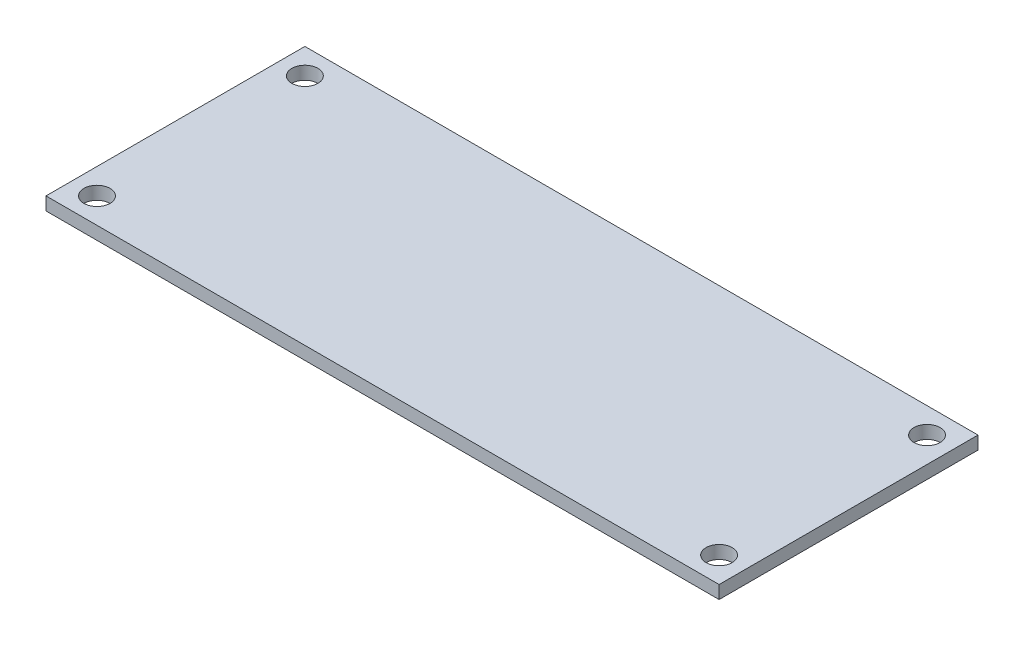
ISO-10303-21;
HEADER;
FILE_DESCRIPTION(('STEP AP214'),'2;1');
FILE_NAME('part.step','',(''),(''),'','','');
FILE_SCHEMA(('AUTOMOTIVE_DESIGN { 1 0 10303 214 1 1 1 1 }'));
ENDSEC;
DATA;
#1=APPLICATION_CONTEXT('core data for automotive mechanical design processes');
#2=APPLICATION_PROTOCOL_DEFINITION('international standard','automotive_design',2000,#1);
#3=PRODUCT_CONTEXT('',#1,'mechanical');
#4=PRODUCT('Part','Part','',(#3));
#5=PRODUCT_RELATED_PRODUCT_CATEGORY('part','',(#4));
#6=PRODUCT_DEFINITION_FORMATION('','',#4);
#7=PRODUCT_DEFINITION_CONTEXT('part definition',#1,'design');
#8=PRODUCT_DEFINITION('design','',#6,#7);
#9=PRODUCT_DEFINITION_SHAPE('','',#8);
#10=(LENGTH_UNIT() NAMED_UNIT(*) SI_UNIT(.MILLI.,.METRE.));
#11=(NAMED_UNIT(*) PLANE_ANGLE_UNIT() SI_UNIT($,.RADIAN.));
#12=(NAMED_UNIT(*) SI_UNIT($,.STERADIAN.) SOLID_ANGLE_UNIT());
#13=UNCERTAINTY_MEASURE_WITH_UNIT(LENGTH_MEASURE(1.E-05),#10,'distance_accuracy_value','');
#14=(GEOMETRIC_REPRESENTATION_CONTEXT(3) GLOBAL_UNCERTAINTY_ASSIGNED_CONTEXT((#13)) GLOBAL_UNIT_ASSIGNED_CONTEXT((#10,
#11,#12)) REPRESENTATION_CONTEXT('',''));
#15=CARTESIAN_POINT('',(0.,0.,0.));
#16=DIRECTION('',(0.,0.,1.));
#17=DIRECTION('',(1.,0.,0.));
#18=AXIS2_PLACEMENT_3D('',#15,#16,#17);
#19=CARTESIAN_POINT('',(0.,0.8,0.));
#20=DIRECTION('',(0.,-1.,0.));
#21=DIRECTION('',(0.,0.,-1.));
#22=AXIS2_PLACEMENT_3D('',#19,#20,#21);
#23=PLANE('',#22);
#24=DIRECTION('',(0.,0.,-1.));
#25=VECTOR('',#24,1.);
#26=CARTESIAN_POINT('',(41.275,0.8,15.875));
#27=LINE('',#26,#25);
#28=CARTESIAN_POINT('',(41.275,0.8,15.875));
#29=VERTEX_POINT('',#28);
#30=CARTESIAN_POINT('',(41.275,0.8,-15.875));
#31=VERTEX_POINT('',#30);
#32=EDGE_CURVE('E86',#29,#31,#27,.T.);
#33=ORIENTED_EDGE('',*,*,#32,.T.);
#34=DIRECTION('',(-1.,0.,0.));
#35=VECTOR('',#34,1.);
#36=CARTESIAN_POINT('',(-41.275,0.8,-15.875));
#37=LINE('',#36,#35);
#38=CARTESIAN_POINT('',(-41.275,0.8,-15.875));
#39=VERTEX_POINT('',#38);
#40=EDGE_CURVE('E81',#31,#39,#37,.T.);
#41=ORIENTED_EDGE('',*,*,#40,.T.);
#42=DIRECTION('',(0.,0.,1.));
#43=VECTOR('',#42,1.);
#44=CARTESIAN_POINT('',(-41.275,0.8,15.875));
#45=LINE('',#44,#43);
#46=CARTESIAN_POINT('',(-41.275,0.8,15.875));
#47=VERTEX_POINT('',#46);
#48=EDGE_CURVE('E84',#39,#47,#45,.T.);
#49=ORIENTED_EDGE('',*,*,#48,.T.);
#50=DIRECTION('',(1.,0.,0.));
#51=VECTOR('',#50,1.);
#52=CARTESIAN_POINT('',(-41.275,0.8,15.875));
#53=LINE('',#52,#51);
#54=EDGE_CURVE('E51',#47,#29,#53,.T.);
#55=ORIENTED_EDGE('',*,*,#54,.T.);
#56=EDGE_LOOP('',(#33,#41,#49,#55));
#57=FACE_BOUND('',#56,.T.);
#58=CARTESIAN_POINT('',(-38.15,0.8,-12.75));
#59=DIRECTION('',(0.,1.,0.));
#60=DIRECTION('',(0.,0.,1.));
#61=AXIS2_PLACEMENT_3D('',#58,#59,#60);
#62=CIRCLE('',#61,1.6);
#63=CARTESIAN_POINT('',(-38.15,0.8,-11.15));
#64=VERTEX_POINT('',#63);
#65=EDGE_CURVE('E101',#64,#64,#62,.T.);
#66=ORIENTED_EDGE('',*,*,#65,.F.);
#67=EDGE_LOOP('',(#66));
#68=FACE_BOUND('',#67,.T.);
#69=CARTESIAN_POINT('',(38.15,0.8,-12.75));
#70=DIRECTION('',(0.,1.,0.));
#71=DIRECTION('',(0.,0.,1.));
#72=AXIS2_PLACEMENT_3D('',#69,#70,#71);
#73=CIRCLE('',#72,1.6);
#74=CARTESIAN_POINT('',(38.15,0.8,-11.15));
#75=VERTEX_POINT('',#74);
#76=EDGE_CURVE('E116',#75,#75,#73,.T.);
#77=ORIENTED_EDGE('',*,*,#76,.F.);
#78=EDGE_LOOP('',(#77));
#79=FACE_BOUND('',#78,.T.);
#80=CARTESIAN_POINT('',(38.15,0.8,12.75));
#81=DIRECTION('',(0.,1.,0.));
#82=DIRECTION('',(0.,0.,1.));
#83=AXIS2_PLACEMENT_3D('',#80,#81,#82);
#84=CIRCLE('',#83,1.6);
#85=CARTESIAN_POINT('',(38.15,0.8,14.35));
#86=VERTEX_POINT('',#85);
#87=EDGE_CURVE('E122',#86,#86,#84,.T.);
#88=ORIENTED_EDGE('',*,*,#87,.F.);
#89=EDGE_LOOP('',(#88));
#90=FACE_BOUND('',#89,.T.);
#91=CARTESIAN_POINT('',(-38.15,0.8,12.75));
#92=DIRECTION('',(0.,1.,0.));
#93=DIRECTION('',(0.,0.,1.));
#94=AXIS2_PLACEMENT_3D('',#91,#92,#93);
#95=CIRCLE('',#94,1.6);
#96=CARTESIAN_POINT('',(-38.15,0.8,14.35));
#97=VERTEX_POINT('',#96);
#98=EDGE_CURVE('E128',#97,#97,#95,.T.);
#99=ORIENTED_EDGE('',*,*,#98,.F.);
#100=EDGE_LOOP('',(#99));
#101=FACE_BOUND('',#100,.T.);
#102=ADVANCED_FACE('F34',(#57,#68,#79,#90,#101),#23,.F.);
#103=CARTESIAN_POINT('',(0.,-0.8,0.));
#104=DIRECTION('',(0.,-1.,0.));
#105=DIRECTION('',(0.,0.,-1.));
#106=AXIS2_PLACEMENT_3D('',#103,#104,#105);
#107=PLANE('',#106);
#108=CARTESIAN_POINT('',(38.15,-0.8,12.75));
#109=DIRECTION('',(0.,1.,0.));
#110=DIRECTION('',(0.,0.,1.));
#111=AXIS2_PLACEMENT_3D('',#108,#109,#110);
#112=CIRCLE('',#111,1.6);
#113=CARTESIAN_POINT('',(38.15,-0.8,14.35));
#114=VERTEX_POINT('',#113);
#115=EDGE_CURVE('E125',#114,#114,#112,.T.);
#116=ORIENTED_EDGE('',*,*,#115,.T.);
#117=EDGE_LOOP('',(#116));
#118=FACE_BOUND('',#117,.T.);
#119=CARTESIAN_POINT('',(-38.15,-0.8,-12.75));
#120=DIRECTION('',(0.,1.,0.));
#121=DIRECTION('',(0.,0.,1.));
#122=AXIS2_PLACEMENT_3D('',#119,#120,#121);
#123=CIRCLE('',#122,1.6);
#124=CARTESIAN_POINT('',(-38.15,-0.8,-11.15));
#125=VERTEX_POINT('',#124);
#126=EDGE_CURVE('E113',#125,#125,#123,.T.);
#127=ORIENTED_EDGE('',*,*,#126,.T.);
#128=EDGE_LOOP('',(#127));
#129=FACE_BOUND('',#128,.T.);
#130=DIRECTION('',(0.,0.,-1.));
#131=VECTOR('',#130,1.);
#132=CARTESIAN_POINT('',(41.275,-0.8,15.875));
#133=LINE('',#132,#131);
#134=CARTESIAN_POINT('',(41.275,-0.8,15.875));
#135=VERTEX_POINT('',#134);
#136=CARTESIAN_POINT('',(41.275,-0.8,-15.875));
#137=VERTEX_POINT('',#136);
#138=EDGE_CURVE('E98',#135,#137,#133,.T.);
#139=ORIENTED_EDGE('',*,*,#138,.F.);
#140=DIRECTION('',(1.,0.,0.));
#141=VECTOR('',#140,1.);
#142=CARTESIAN_POINT('',(-41.275,-0.8,15.875));
#143=LINE('',#142,#141);
#144=CARTESIAN_POINT('',(-41.275,-0.8,15.875));
#145=VERTEX_POINT('',#144);
#146=EDGE_CURVE('E74',#145,#135,#143,.T.);
#147=ORIENTED_EDGE('',*,*,#146,.F.);
#148=DIRECTION('',(0.,0.,1.));
#149=VECTOR('',#148,1.);
#150=CARTESIAN_POINT('',(-41.275,-0.8,15.875));
#151=LINE('',#150,#149);
#152=CARTESIAN_POINT('',(-41.275,-0.8,-15.875));
#153=VERTEX_POINT('',#152);
#154=EDGE_CURVE('E68',#153,#145,#151,.T.);
#155=ORIENTED_EDGE('',*,*,#154,.F.);
#156=DIRECTION('',(-1.,0.,0.));
#157=VECTOR('',#156,1.);
#158=CARTESIAN_POINT('',(-41.275,-0.8,-15.875));
#159=LINE('',#158,#157);
#160=EDGE_CURVE('E90',#137,#153,#159,.T.);
#161=ORIENTED_EDGE('',*,*,#160,.F.);
#162=EDGE_LOOP('',(#139,#147,#155,#161));
#163=FACE_BOUND('',#162,.T.);
#164=CARTESIAN_POINT('',(38.15,-0.8,-12.75));
#165=DIRECTION('',(0.,1.,0.));
#166=DIRECTION('',(0.,0.,1.));
#167=AXIS2_PLACEMENT_3D('',#164,#165,#166);
#168=CIRCLE('',#167,1.6);
#169=CARTESIAN_POINT('',(38.15,-0.8,-11.15));
#170=VERTEX_POINT('',#169);
#171=EDGE_CURVE('E119',#170,#170,#168,.T.);
#172=ORIENTED_EDGE('',*,*,#171,.T.);
#173=EDGE_LOOP('',(#172));
#174=FACE_BOUND('',#173,.T.);
#175=CARTESIAN_POINT('',(-38.15,-0.8,12.75));
#176=DIRECTION('',(0.,1.,0.));
#177=DIRECTION('',(0.,0.,1.));
#178=AXIS2_PLACEMENT_3D('',#175,#176,#177);
#179=CIRCLE('',#178,1.6);
#180=CARTESIAN_POINT('',(-38.15,-0.8,14.35));
#181=VERTEX_POINT('',#180);
#182=EDGE_CURVE('E131',#181,#181,#179,.T.);
#183=ORIENTED_EDGE('',*,*,#182,.T.);
#184=EDGE_LOOP('',(#183));
#185=FACE_BOUND('',#184,.T.);
#186=ADVANCED_FACE('F109',(#118,#129,#163,#174,#185),#107,.T.);
#187=CARTESIAN_POINT('',(41.275,0.8,15.875));
#188=DIRECTION('',(-1.,0.,0.));
#189=DIRECTION('',(0.,0.,1.));
#190=AXIS2_PLACEMENT_3D('',#187,#188,#189);
#191=PLANE('',#190);
#192=ORIENTED_EDGE('',*,*,#138,.T.);
#193=DIRECTION('',(0.,-1.,0.));
#194=VECTOR('',#193,1.);
#195=CARTESIAN_POINT('',(41.275,0.8,-15.875));
#196=LINE('',#195,#194);
#197=EDGE_CURVE('E11',#31,#137,#196,.T.);
#198=ORIENTED_EDGE('',*,*,#197,.F.);
#199=ORIENTED_EDGE('',*,*,#32,.F.);
#200=DIRECTION('',(0.,-1.,0.));
#201=VECTOR('',#200,1.);
#202=CARTESIAN_POINT('',(41.275,0.8,15.875));
#203=LINE('',#202,#201);
#204=EDGE_CURVE('E94',#29,#135,#203,.T.);
#205=ORIENTED_EDGE('',*,*,#204,.T.);
#206=EDGE_LOOP('',(#192,#198,#199,#205));
#207=FACE_BOUND('',#206,.T.);
#208=ADVANCED_FACE('F36',(#207),#191,.F.);
#209=CARTESIAN_POINT('',(-41.275,0.8,-15.875));
#210=DIRECTION('',(0.,0.,1.));
#211=DIRECTION('',(1.,0.,0.));
#212=AXIS2_PLACEMENT_3D('',#209,#210,#211);
#213=PLANE('',#212);
#214=ORIENTED_EDGE('',*,*,#160,.T.);
#215=DIRECTION('',(0.,-1.,0.));
#216=VECTOR('',#215,1.);
#217=CARTESIAN_POINT('',(-41.275,0.8,-15.875));
#218=LINE('',#217,#216);
#219=EDGE_CURVE('E43',#39,#153,#218,.T.);
#220=ORIENTED_EDGE('',*,*,#219,.F.);
#221=ORIENTED_EDGE('',*,*,#40,.F.);
#222=ORIENTED_EDGE('',*,*,#197,.T.);
#223=EDGE_LOOP('',(#214,#220,#221,#222));
#224=FACE_BOUND('',#223,.T.);
#225=ADVANCED_FACE('F89',(#224),#213,.F.);
#226=CARTESIAN_POINT('',(-41.275,0.8,15.875));
#227=DIRECTION('',(1.,0.,0.));
#228=DIRECTION('',(0.,0.,-1.));
#229=AXIS2_PLACEMENT_3D('',#226,#227,#228);
#230=PLANE('',#229);
#231=ORIENTED_EDGE('',*,*,#154,.T.);
#232=DIRECTION('',(0.,-1.,0.));
#233=VECTOR('',#232,1.);
#234=CARTESIAN_POINT('',(-41.275,0.8,15.875));
#235=LINE('',#234,#233);
#236=EDGE_CURVE('E91',#47,#145,#235,.T.);
#237=ORIENTED_EDGE('',*,*,#236,.F.);
#238=ORIENTED_EDGE('',*,*,#48,.F.);
#239=ORIENTED_EDGE('',*,*,#219,.T.);
#240=EDGE_LOOP('',(#231,#237,#238,#239));
#241=FACE_BOUND('',#240,.T.);
#242=ADVANCED_FACE('F92',(#241),#230,.F.);
#243=CARTESIAN_POINT('',(-41.275,0.8,15.875));
#244=DIRECTION('',(0.,0.,-1.));
#245=DIRECTION('',(-1.,0.,0.));
#246=AXIS2_PLACEMENT_3D('',#243,#244,#245);
#247=PLANE('',#246);
#248=ORIENTED_EDGE('',*,*,#146,.T.);
#249=ORIENTED_EDGE('',*,*,#204,.F.);
#250=ORIENTED_EDGE('',*,*,#54,.F.);
#251=ORIENTED_EDGE('',*,*,#236,.T.);
#252=EDGE_LOOP('',(#248,#249,#250,#251));
#253=FACE_BOUND('',#252,.T.);
#254=ADVANCED_FACE('F106',(#253),#247,.F.);
#255=CARTESIAN_POINT('',(-38.15,0.8,-12.75));
#256=DIRECTION('',(0.,-1.,0.));
#257=DIRECTION('',(0.,0.,-1.));
#258=AXIS2_PLACEMENT_3D('',#255,#256,#257);
#259=CYLINDRICAL_SURFACE('',#258,1.6);
#260=ORIENTED_EDGE('',*,*,#65,.T.);
#261=EDGE_LOOP('',(#260));
#262=FACE_BOUND('',#261,.T.);
#263=ORIENTED_EDGE('',*,*,#126,.F.);
#264=EDGE_LOOP('',(#263));
#265=FACE_BOUND('',#264,.T.);
#266=ADVANCED_FACE('F148',(#262,#265),#259,.F.);
#267=CARTESIAN_POINT('',(38.15,0.8,-12.75));
#268=DIRECTION('',(0.,-1.,0.));
#269=DIRECTION('',(0.,0.,-1.));
#270=AXIS2_PLACEMENT_3D('',#267,#268,#269);
#271=CYLINDRICAL_SURFACE('',#270,1.6);
#272=ORIENTED_EDGE('',*,*,#76,.T.);
#273=EDGE_LOOP('',(#272));
#274=FACE_BOUND('',#273,.T.);
#275=ORIENTED_EDGE('',*,*,#171,.F.);
#276=EDGE_LOOP('',(#275));
#277=FACE_BOUND('',#276,.T.);
#278=ADVANCED_FACE('F194',(#274,#277),#271,.F.);
#279=CARTESIAN_POINT('',(38.15,0.8,12.75));
#280=DIRECTION('',(0.,-1.,0.));
#281=DIRECTION('',(0.,0.,-1.));
#282=AXIS2_PLACEMENT_3D('',#279,#280,#281);
#283=CYLINDRICAL_SURFACE('',#282,1.6);
#284=ORIENTED_EDGE('',*,*,#87,.T.);
#285=EDGE_LOOP('',(#284));
#286=FACE_BOUND('',#285,.T.);
#287=ORIENTED_EDGE('',*,*,#115,.F.);
#288=EDGE_LOOP('',(#287));
#289=FACE_BOUND('',#288,.T.);
#290=ADVANCED_FACE('F202',(#286,#289),#283,.F.);
#291=CARTESIAN_POINT('',(-38.15,0.8,12.75));
#292=DIRECTION('',(0.,-1.,0.));
#293=DIRECTION('',(0.,0.,-1.));
#294=AXIS2_PLACEMENT_3D('',#291,#292,#293);
#295=CYLINDRICAL_SURFACE('',#294,1.6);
#296=ORIENTED_EDGE('',*,*,#98,.T.);
#297=EDGE_LOOP('',(#296));
#298=FACE_BOUND('',#297,.T.);
#299=ORIENTED_EDGE('',*,*,#182,.F.);
#300=EDGE_LOOP('',(#299));
#301=FACE_BOUND('',#300,.T.);
#302=ADVANCED_FACE('F137',(#298,#301),#295,.F.);
#303=CLOSED_SHELL('',(#102,#186,#208,#225,#242,#254,#266,#278,#290,#302));
#304=MANIFOLD_SOLID_BREP('B2',#303);
#305=ADVANCED_BREP_SHAPE_REPRESENTATION('',(#18,#304),#14);
#306=SHAPE_DEFINITION_REPRESENTATION(#9,#305);
ENDSEC;
END-ISO-10303-21;
